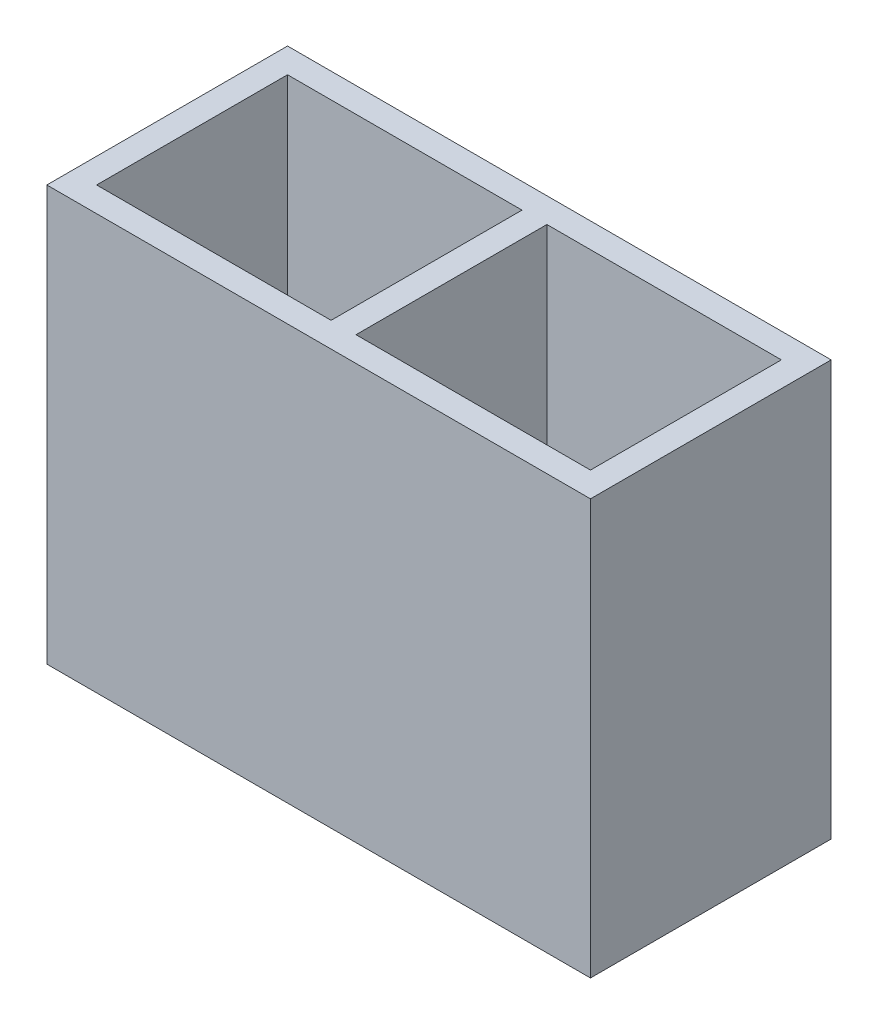
ISO-10303-21;
HEADER;
FILE_DESCRIPTION(('STEP AP214'),'2;1');
FILE_NAME('part.step','',(''),(''),'','','');
FILE_SCHEMA(('AUTOMOTIVE_DESIGN { 1 0 10303 214 1 1 1 1 }'));
ENDSEC;
DATA;
#1=APPLICATION_CONTEXT('core data for automotive mechanical design processes');
#2=APPLICATION_PROTOCOL_DEFINITION('international standard','automotive_design',2000,#1);
#3=PRODUCT_CONTEXT('',#1,'mechanical');
#4=PRODUCT('Part','Part','',(#3));
#5=PRODUCT_RELATED_PRODUCT_CATEGORY('part','',(#4));
#6=PRODUCT_DEFINITION_FORMATION('','',#4);
#7=PRODUCT_DEFINITION_CONTEXT('part definition',#1,'design');
#8=PRODUCT_DEFINITION('design','',#6,#7);
#9=PRODUCT_DEFINITION_SHAPE('','',#8);
#10=(LENGTH_UNIT() NAMED_UNIT(*) SI_UNIT(.MILLI.,.METRE.));
#11=(NAMED_UNIT(*) PLANE_ANGLE_UNIT() SI_UNIT($,.RADIAN.));
#12=(NAMED_UNIT(*) SI_UNIT($,.STERADIAN.) SOLID_ANGLE_UNIT());
#13=UNCERTAINTY_MEASURE_WITH_UNIT(LENGTH_MEASURE(1.E-05),#10,'distance_accuracy_value','');
#14=(GEOMETRIC_REPRESENTATION_CONTEXT(3) GLOBAL_UNCERTAINTY_ASSIGNED_CONTEXT((#13)) GLOBAL_UNIT_ASSIGNED_CONTEXT((#10,
#11,#12)) REPRESENTATION_CONTEXT('',''));
#15=CARTESIAN_POINT('',(0.,0.,0.));
#16=DIRECTION('',(0.,0.,1.));
#17=DIRECTION('',(1.,0.,0.));
#18=AXIS2_PLACEMENT_3D('',#15,#16,#17);
#19=CARTESIAN_POINT('',(-6.55,-5.,-2.9));
#20=DIRECTION('',(-1.,0.,0.));
#21=DIRECTION('',(0.,0.,1.));
#22=AXIS2_PLACEMENT_3D('',#19,#20,#21);
#23=PLANE('',#22);
#24=DIRECTION('',(0.,1.,0.));
#25=VECTOR('',#24,1.);
#26=CARTESIAN_POINT('',(-6.55,-5.,2.9));
#27=LINE('',#26,#25);
#28=CARTESIAN_POINT('',(-6.55,-5.,2.9));
#29=VERTEX_POINT('',#28);
#30=CARTESIAN_POINT('',(-6.55,5.,2.9));
#31=VERTEX_POINT('',#30);
#32=EDGE_CURVE('E213',#29,#31,#27,.T.);
#33=ORIENTED_EDGE('',*,*,#32,.T.);
#34=DIRECTION('',(0.,0.,1.));
#35=VECTOR('',#34,1.);
#36=CARTESIAN_POINT('',(-6.55,5.,-2.9));
#37=LINE('',#36,#35);
#38=CARTESIAN_POINT('',(-6.55,5.,-2.9));
#39=VERTEX_POINT('',#38);
#40=EDGE_CURVE('E163',#39,#31,#37,.T.);
#41=ORIENTED_EDGE('',*,*,#40,.F.);
#42=DIRECTION('',(0.,1.,0.));
#43=VECTOR('',#42,1.);
#44=CARTESIAN_POINT('',(-6.55,-5.,-2.9));
#45=LINE('',#44,#43);
#46=CARTESIAN_POINT('',(-6.55,-5.,-2.9));
#47=VERTEX_POINT('',#46);
#48=EDGE_CURVE('E12',#47,#39,#45,.T.);
#49=ORIENTED_EDGE('',*,*,#48,.F.);
#50=DIRECTION('',(0.,0.,1.));
#51=VECTOR('',#50,1.);
#52=CARTESIAN_POINT('',(-6.55,-5.,-2.9));
#53=LINE('',#52,#51);
#54=EDGE_CURVE('E202',#47,#29,#53,.T.);
#55=ORIENTED_EDGE('',*,*,#54,.T.);
#56=EDGE_LOOP('',(#33,#41,#49,#55));
#57=FACE_BOUND('',#56,.T.);
#58=ADVANCED_FACE('F39',(#57),#23,.T.);
#59=CARTESIAN_POINT('',(-6.55,-5.,-2.9));
#60=DIRECTION('',(0.,0.,-1.));
#61=DIRECTION('',(-1.,0.,0.));
#62=AXIS2_PLACEMENT_3D('',#59,#60,#61);
#63=PLANE('',#62);
#64=ORIENTED_EDGE('',*,*,#48,.T.);
#65=DIRECTION('',(-1.,0.,0.));
#66=VECTOR('',#65,1.);
#67=CARTESIAN_POINT('',(-6.55,5.,-2.9));
#68=LINE('',#67,#66);
#69=CARTESIAN_POINT('',(6.55,5.,-2.9));
#70=VERTEX_POINT('',#69);
#71=EDGE_CURVE('E199',#70,#39,#68,.T.);
#72=ORIENTED_EDGE('',*,*,#71,.F.);
#73=DIRECTION('',(0.,1.,0.));
#74=VECTOR('',#73,1.);
#75=CARTESIAN_POINT('',(6.55,-5.,-2.9));
#76=LINE('',#75,#74);
#77=CARTESIAN_POINT('',(6.55,-5.,-2.9));
#78=VERTEX_POINT('',#77);
#79=EDGE_CURVE('E47',#78,#70,#76,.T.);
#80=ORIENTED_EDGE('',*,*,#79,.F.);
#81=DIRECTION('',(-1.,0.,0.));
#82=VECTOR('',#81,1.);
#83=CARTESIAN_POINT('',(-6.55,-5.,-2.9));
#84=LINE('',#83,#82);
#85=EDGE_CURVE('E211',#78,#47,#84,.T.);
#86=ORIENTED_EDGE('',*,*,#85,.T.);
#87=EDGE_LOOP('',(#64,#72,#80,#86));
#88=FACE_BOUND('',#87,.T.);
#89=ADVANCED_FACE('F268',(#88),#63,.T.);
#90=CARTESIAN_POINT('',(6.55,-5.,-2.9));
#91=DIRECTION('',(1.,0.,0.));
#92=DIRECTION('',(0.,0.,-1.));
#93=AXIS2_PLACEMENT_3D('',#90,#91,#92);
#94=PLANE('',#93);
#95=ORIENTED_EDGE('',*,*,#79,.T.);
#96=DIRECTION('',(0.,0.,-1.));
#97=VECTOR('',#96,1.);
#98=CARTESIAN_POINT('',(6.55,5.,-2.9));
#99=LINE('',#98,#97);
#100=CARTESIAN_POINT('',(6.55,5.,2.9));
#101=VERTEX_POINT('',#100);
#102=EDGE_CURVE('E196',#101,#70,#99,.T.);
#103=ORIENTED_EDGE('',*,*,#102,.F.);
#104=DIRECTION('',(0.,1.,0.));
#105=VECTOR('',#104,1.);
#106=CARTESIAN_POINT('',(6.55,-5.,2.9));
#107=LINE('',#106,#105);
#108=CARTESIAN_POINT('',(6.55,-5.,2.9));
#109=VERTEX_POINT('',#108);
#110=EDGE_CURVE('E216',#109,#101,#107,.T.);
#111=ORIENTED_EDGE('',*,*,#110,.F.);
#112=DIRECTION('',(0.,0.,-1.));
#113=VECTOR('',#112,1.);
#114=CARTESIAN_POINT('',(6.55,-5.,-2.9));
#115=LINE('',#114,#113);
#116=EDGE_CURVE('E208',#109,#78,#115,.T.);
#117=ORIENTED_EDGE('',*,*,#116,.T.);
#118=EDGE_LOOP('',(#95,#103,#111,#117));
#119=FACE_BOUND('',#118,.T.);
#120=ADVANCED_FACE('F273',(#119),#94,.T.);
#121=CARTESIAN_POINT('',(-6.55,-5.,2.9));
#122=DIRECTION('',(0.,0.,1.));
#123=DIRECTION('',(1.,0.,0.));
#124=AXIS2_PLACEMENT_3D('',#121,#122,#123);
#125=PLANE('',#124);
#126=ORIENTED_EDGE('',*,*,#110,.T.);
#127=DIRECTION('',(1.,0.,0.));
#128=VECTOR('',#127,1.);
#129=CARTESIAN_POINT('',(-6.55,5.,2.9));
#130=LINE('',#129,#128);
#131=EDGE_CURVE('E193',#31,#101,#130,.T.);
#132=ORIENTED_EDGE('',*,*,#131,.F.);
#133=ORIENTED_EDGE('',*,*,#32,.F.);
#134=DIRECTION('',(1.,0.,0.));
#135=VECTOR('',#134,1.);
#136=CARTESIAN_POINT('',(-6.55,-5.,2.9));
#137=LINE('',#136,#135);
#138=EDGE_CURVE('E205',#29,#109,#137,.T.);
#139=ORIENTED_EDGE('',*,*,#138,.T.);
#140=EDGE_LOOP('',(#126,#132,#133,#139));
#141=FACE_BOUND('',#140,.T.);
#142=ADVANCED_FACE('F281',(#141),#125,.T.);
#143=CARTESIAN_POINT('',(0.,-5.,0.));
#144=DIRECTION('',(0.,1.,0.));
#145=DIRECTION('',(0.,0.,1.));
#146=AXIS2_PLACEMENT_3D('',#143,#144,#145);
#147=PLANE('',#146);
#148=CARTESIAN_POINT('',(-4.625,-5.,0.));
#149=DIRECTION('',(0.,1.,0.));
#150=DIRECTION('',(0.,0.,1.));
#151=AXIS2_PLACEMENT_3D('',#148,#149,#150);
#152=CIRCLE('',#151,0.750000000000001);
#153=CARTESIAN_POINT('',(-4.625,-5.,0.750000000000001));
#154=VERTEX_POINT('',#153);
#155=EDGE_CURVE('E223',#154,#154,#152,.T.);
#156=ORIENTED_EDGE('',*,*,#155,.T.);
#157=EDGE_LOOP('',(#156));
#158=FACE_BOUND('',#157,.T.);
#159=CARTESIAN_POINT('',(-1.625,-5.,0.));
#160=DIRECTION('',(0.,1.,0.));
#161=DIRECTION('',(0.,0.,-1.));
#162=AXIS2_PLACEMENT_3D('',#159,#160,#161);
#163=CIRCLE('',#162,0.75);
#164=CARTESIAN_POINT('',(-1.625,-5.,-0.75));
#165=VERTEX_POINT('',#164);
#166=EDGE_CURVE('E462',#165,#165,#163,.T.);
#167=ORIENTED_EDGE('',*,*,#166,.T.);
#168=EDGE_LOOP('',(#167));
#169=FACE_BOUND('',#168,.T.);
#170=CARTESIAN_POINT('',(1.625,-5.,0.));
#171=DIRECTION('',(0.,1.,0.));
#172=DIRECTION('',(0.,0.,1.));
#173=AXIS2_PLACEMENT_3D('',#170,#171,#172);
#174=CIRCLE('',#173,0.75);
#175=CARTESIAN_POINT('',(1.625,-5.,0.750000000000001));
#176=VERTEX_POINT('',#175);
#177=EDGE_CURVE('E459',#176,#176,#174,.T.);
#178=ORIENTED_EDGE('',*,*,#177,.T.);
#179=EDGE_LOOP('',(#178));
#180=FACE_BOUND('',#179,.T.);
#181=CARTESIAN_POINT('',(4.625,-5.,0.));
#182=DIRECTION('',(0.,1.,0.));
#183=DIRECTION('',(0.,0.,-1.));
#184=AXIS2_PLACEMENT_3D('',#181,#182,#183);
#185=CIRCLE('',#184,0.750000000000001);
#186=CARTESIAN_POINT('',(4.625,-5.,-0.750000000000001));
#187=VERTEX_POINT('',#186);
#188=EDGE_CURVE('E457',#187,#187,#185,.T.);
#189=ORIENTED_EDGE('',*,*,#188,.T.);
#190=EDGE_LOOP('',(#189));
#191=FACE_BOUND('',#190,.T.);
#192=ORIENTED_EDGE('',*,*,#54,.F.);
#193=ORIENTED_EDGE('',*,*,#85,.F.);
#194=ORIENTED_EDGE('',*,*,#116,.F.);
#195=ORIENTED_EDGE('',*,*,#138,.F.);
#196=EDGE_LOOP('',(#192,#193,#194,#195));
#197=FACE_BOUND('',#196,.T.);
#198=ADVANCED_FACE('F286',(#158,#169,#180,#191,#197),#147,.F.);
#199=CARTESIAN_POINT('',(0.,5.,0.));
#200=DIRECTION('',(0.,1.,0.));
#201=DIRECTION('',(0.,0.,1.));
#202=AXIS2_PLACEMENT_3D('',#199,#200,#201);
#203=PLANE('',#202);
#204=DIRECTION('',(0.,0.,1.));
#205=VECTOR('',#204,1.);
#206=CARTESIAN_POINT('',(-5.95,5.,-2.3));
#207=LINE('',#206,#205);
#208=CARTESIAN_POINT('',(-5.95,5.,-2.3));
#209=VERTEX_POINT('',#208);
#210=CARTESIAN_POINT('',(-5.95,5.,2.3));
#211=VERTEX_POINT('',#210);
#212=EDGE_CURVE('E55',#209,#211,#207,.T.);
#213=ORIENTED_EDGE('',*,*,#212,.F.);
#214=DIRECTION('',(-1.,0.,0.));
#215=VECTOR('',#214,1.);
#216=CARTESIAN_POINT('',(-5.95,5.,-2.3));
#217=LINE('',#216,#215);
#218=CARTESIAN_POINT('',(-0.3,5.,-2.3));
#219=VERTEX_POINT('',#218);
#220=EDGE_CURVE('E152',#219,#209,#217,.T.);
#221=ORIENTED_EDGE('',*,*,#220,.F.);
#222=DIRECTION('',(0.,0.,-1.));
#223=VECTOR('',#222,1.);
#224=CARTESIAN_POINT('',(-0.3,5.,-2.3));
#225=LINE('',#224,#223);
#226=CARTESIAN_POINT('',(-0.3,5.,2.3));
#227=VERTEX_POINT('',#226);
#228=EDGE_CURVE('E135',#227,#219,#225,.T.);
#229=ORIENTED_EDGE('',*,*,#228,.F.);
#230=DIRECTION('',(1.,0.,0.));
#231=VECTOR('',#230,1.);
#232=CARTESIAN_POINT('',(-5.95,5.,2.3));
#233=LINE('',#232,#231);
#234=EDGE_CURVE('E145',#211,#227,#233,.T.);
#235=ORIENTED_EDGE('',*,*,#234,.F.);
#236=EDGE_LOOP('',(#213,#221,#229,#235));
#237=FACE_BOUND('',#236,.T.);
#238=DIRECTION('',(1.,0.,0.));
#239=VECTOR('',#238,1.);
#240=CARTESIAN_POINT('',(0.3,5.,2.3));
#241=LINE('',#240,#239);
#242=CARTESIAN_POINT('',(0.3,5.,2.3));
#243=VERTEX_POINT('',#242);
#244=CARTESIAN_POINT('',(5.95,5.,2.3));
#245=VERTEX_POINT('',#244);
#246=EDGE_CURVE('E63',#243,#245,#241,.T.);
#247=ORIENTED_EDGE('',*,*,#246,.F.);
#248=DIRECTION('',(0.,0.,1.));
#249=VECTOR('',#248,1.);
#250=CARTESIAN_POINT('',(0.3,5.,-2.3));
#251=LINE('',#250,#249);
#252=CARTESIAN_POINT('',(0.3,5.,-2.3));
#253=VERTEX_POINT('',#252);
#254=EDGE_CURVE('E180',#253,#243,#251,.T.);
#255=ORIENTED_EDGE('',*,*,#254,.F.);
#256=DIRECTION('',(-1.,0.,0.));
#257=VECTOR('',#256,1.);
#258=CARTESIAN_POINT('',(0.3,5.,-2.3));
#259=LINE('',#258,#257);
#260=CARTESIAN_POINT('',(5.95,5.,-2.3));
#261=VERTEX_POINT('',#260);
#262=EDGE_CURVE('E177',#261,#253,#259,.T.);
#263=ORIENTED_EDGE('',*,*,#262,.F.);
#264=DIRECTION('',(0.,0.,-1.));
#265=VECTOR('',#264,1.);
#266=CARTESIAN_POINT('',(5.95,5.,-2.3));
#267=LINE('',#266,#265);
#268=EDGE_CURVE('E174',#245,#261,#267,.T.);
#269=ORIENTED_EDGE('',*,*,#268,.F.);
#270=EDGE_LOOP('',(#247,#255,#263,#269));
#271=FACE_BOUND('',#270,.T.);
#272=ORIENTED_EDGE('',*,*,#40,.T.);
#273=ORIENTED_EDGE('',*,*,#131,.T.);
#274=ORIENTED_EDGE('',*,*,#102,.T.);
#275=ORIENTED_EDGE('',*,*,#71,.T.);
#276=EDGE_LOOP('',(#272,#273,#274,#275));
#277=FACE_BOUND('',#276,.T.);
#278=ADVANCED_FACE('F149',(#237,#271,#277),#203,.T.);
#279=CARTESIAN_POINT('',(0.3,-12.2857738092807,2.3));
#280=DIRECTION('',(0.,0.,1.));
#281=DIRECTION('',(1.,0.,0.));
#282=AXIS2_PLACEMENT_3D('',#279,#280,#281);
#283=PLANE('',#282);
#284=DIRECTION('',(-1.,0.,0.));
#285=VECTOR('',#284,1.);
#286=CARTESIAN_POINT('',(0.3,-1.6,2.3));
#287=LINE('',#286,#285);
#288=CARTESIAN_POINT('',(5.95,-1.6,2.3));
#289=VERTEX_POINT('',#288);
#290=CARTESIAN_POINT('',(0.3,-1.6,2.3));
#291=VERTEX_POINT('',#290);
#292=EDGE_CURVE('E170',#289,#291,#287,.T.);
#293=ORIENTED_EDGE('',*,*,#292,.T.);
#294=DIRECTION('',(0.,1.,0.));
#295=VECTOR('',#294,1.);
#296=CARTESIAN_POINT('',(0.3,-12.2857738092807,2.3));
#297=LINE('',#296,#295);
#298=EDGE_CURVE('E168',#291,#243,#297,.T.);
#299=ORIENTED_EDGE('',*,*,#298,.T.);
#300=ORIENTED_EDGE('',*,*,#246,.T.);
#301=DIRECTION('',(0.,1.,0.));
#302=VECTOR('',#301,1.);
#303=CARTESIAN_POINT('',(5.95,-12.2857738092807,2.3));
#304=LINE('',#303,#302);
#305=EDGE_CURVE('E183',#289,#245,#304,.T.);
#306=ORIENTED_EDGE('',*,*,#305,.F.);
#307=EDGE_LOOP('',(#293,#299,#300,#306));
#308=FACE_BOUND('',#307,.T.);
#309=ADVANCED_FACE('F247',(#308),#283,.F.);
#310=CARTESIAN_POINT('',(0.3,-12.2857738092807,-2.3));
#311=DIRECTION('',(-1.,0.,0.));
#312=DIRECTION('',(0.,0.,1.));
#313=AXIS2_PLACEMENT_3D('',#310,#311,#312);
#314=PLANE('',#313);
#315=DIRECTION('',(0.,0.,-1.));
#316=VECTOR('',#315,1.);
#317=CARTESIAN_POINT('',(0.3,-1.6,-2.3));
#318=LINE('',#317,#316);
#319=CARTESIAN_POINT('',(0.3,-1.6,-2.3));
#320=VERTEX_POINT('',#319);
#321=EDGE_CURVE('E167',#291,#320,#318,.T.);
#322=ORIENTED_EDGE('',*,*,#321,.T.);
#323=DIRECTION('',(0.,1.,0.));
#324=VECTOR('',#323,1.);
#325=CARTESIAN_POINT('',(0.3,-12.2857738092807,-2.3));
#326=LINE('',#325,#324);
#327=EDGE_CURVE('E185',#320,#253,#326,.T.);
#328=ORIENTED_EDGE('',*,*,#327,.T.);
#329=ORIENTED_EDGE('',*,*,#254,.T.);
#330=ORIENTED_EDGE('',*,*,#298,.F.);
#331=EDGE_LOOP('',(#322,#328,#329,#330));
#332=FACE_BOUND('',#331,.T.);
#333=ADVANCED_FACE('F258',(#332),#314,.F.);
#334=CARTESIAN_POINT('',(0.3,-12.2857738092807,-2.3));
#335=DIRECTION('',(0.,0.,-1.));
#336=DIRECTION('',(-1.,0.,0.));
#337=AXIS2_PLACEMENT_3D('',#334,#335,#336);
#338=PLANE('',#337);
#339=DIRECTION('',(1.,0.,0.));
#340=VECTOR('',#339,1.);
#341=CARTESIAN_POINT('',(0.3,-1.6,-2.3));
#342=LINE('',#341,#340);
#343=CARTESIAN_POINT('',(5.95,-1.6,-2.3));
#344=VERTEX_POINT('',#343);
#345=EDGE_CURVE('E165',#320,#344,#342,.T.);
#346=ORIENTED_EDGE('',*,*,#345,.T.);
#347=DIRECTION('',(0.,1.,0.));
#348=VECTOR('',#347,1.);
#349=CARTESIAN_POINT('',(5.95,-12.2857738092807,-2.3));
#350=LINE('',#349,#348);
#351=EDGE_CURVE('E187',#344,#261,#350,.T.);
#352=ORIENTED_EDGE('',*,*,#351,.T.);
#353=ORIENTED_EDGE('',*,*,#262,.T.);
#354=ORIENTED_EDGE('',*,*,#327,.F.);
#355=EDGE_LOOP('',(#346,#352,#353,#354));
#356=FACE_BOUND('',#355,.T.);
#357=ADVANCED_FACE('F256',(#356),#338,.F.);
#358=CARTESIAN_POINT('',(5.95,-12.2857738092807,-2.3));
#359=DIRECTION('',(1.,0.,0.));
#360=DIRECTION('',(0.,0.,-1.));
#361=AXIS2_PLACEMENT_3D('',#358,#359,#360);
#362=PLANE('',#361);
#363=DIRECTION('',(0.,0.,1.));
#364=VECTOR('',#363,1.);
#365=CARTESIAN_POINT('',(5.95,-1.6,-2.3));
#366=LINE('',#365,#364);
#367=EDGE_CURVE('E172',#344,#289,#366,.T.);
#368=ORIENTED_EDGE('',*,*,#367,.T.);
#369=ORIENTED_EDGE('',*,*,#305,.T.);
#370=ORIENTED_EDGE('',*,*,#268,.T.);
#371=ORIENTED_EDGE('',*,*,#351,.F.);
#372=EDGE_LOOP('',(#368,#369,#370,#371));
#373=FACE_BOUND('',#372,.T.);
#374=ADVANCED_FACE('F239',(#373),#362,.F.);
#375=CARTESIAN_POINT('',(0.,-1.6,0.));
#376=DIRECTION('',(0.,1.,0.));
#377=DIRECTION('',(0.,0.,1.));
#378=AXIS2_PLACEMENT_3D('',#375,#376,#377);
#379=PLANE('',#378);
#380=CARTESIAN_POINT('',(1.625,-1.6,0.));
#381=DIRECTION('',(0.,1.,0.));
#382=DIRECTION('',(0.,0.,1.));
#383=AXIS2_PLACEMENT_3D('',#380,#381,#382);
#384=CIRCLE('',#383,0.75);
#385=CARTESIAN_POINT('',(1.625,-1.6,0.750000000000001));
#386=VERTEX_POINT('',#385);
#387=EDGE_CURVE('E42',#386,#386,#384,.T.);
#388=ORIENTED_EDGE('',*,*,#387,.F.);
#389=EDGE_LOOP('',(#388));
#390=FACE_BOUND('',#389,.T.);
#391=CARTESIAN_POINT('',(4.625,-1.6,0.));
#392=DIRECTION('',(0.,1.,0.));
#393=DIRECTION('',(0.,0.,1.));
#394=AXIS2_PLACEMENT_3D('',#391,#392,#393);
#395=CIRCLE('',#394,0.750000000000001);
#396=CARTESIAN_POINT('',(4.625,-1.6,0.750000000000001));
#397=VERTEX_POINT('',#396);
#398=EDGE_CURVE('E225',#397,#397,#395,.T.);
#399=ORIENTED_EDGE('',*,*,#398,.F.);
#400=EDGE_LOOP('',(#399));
#401=FACE_BOUND('',#400,.T.);
#402=ORIENTED_EDGE('',*,*,#292,.F.);
#403=ORIENTED_EDGE('',*,*,#367,.F.);
#404=ORIENTED_EDGE('',*,*,#345,.F.);
#405=ORIENTED_EDGE('',*,*,#321,.F.);
#406=EDGE_LOOP('',(#402,#403,#404,#405));
#407=FACE_BOUND('',#406,.T.);
#408=ADVANCED_FACE('F235',(#390,#401,#407),#379,.T.);
#409=CARTESIAN_POINT('',(-5.95,-12.2857738092807,-2.3));
#410=DIRECTION('',(-1.,0.,0.));
#411=DIRECTION('',(0.,0.,1.));
#412=AXIS2_PLACEMENT_3D('',#409,#410,#411);
#413=PLANE('',#412);
#414=DIRECTION('',(0.,0.,-1.));
#415=VECTOR('',#414,1.);
#416=CARTESIAN_POINT('',(-5.95,-1.6,-2.3));
#417=LINE('',#416,#415);
#418=CARTESIAN_POINT('',(-5.95,-1.6,2.3));
#419=VERTEX_POINT('',#418);
#420=CARTESIAN_POINT('',(-5.95,-1.6,-2.3));
#421=VERTEX_POINT('',#420);
#422=EDGE_CURVE('E164',#419,#421,#417,.T.);
#423=ORIENTED_EDGE('',*,*,#422,.T.);
#424=DIRECTION('',(0.,1.,0.));
#425=VECTOR('',#424,1.);
#426=CARTESIAN_POINT('',(-5.95,-12.2857738092807,-2.3));
#427=LINE('',#426,#425);
#428=EDGE_CURVE('E157',#421,#209,#427,.T.);
#429=ORIENTED_EDGE('',*,*,#428,.T.);
#430=ORIENTED_EDGE('',*,*,#212,.T.);
#431=DIRECTION('',(0.,1.,0.));
#432=VECTOR('',#431,1.);
#433=CARTESIAN_POINT('',(-5.95,-12.2857738092807,2.3));
#434=LINE('',#433,#432);
#435=EDGE_CURVE('E142',#419,#211,#434,.T.);
#436=ORIENTED_EDGE('',*,*,#435,.F.);
#437=EDGE_LOOP('',(#423,#429,#430,#436));
#438=FACE_BOUND('',#437,.T.);
#439=ADVANCED_FACE('F238',(#438),#413,.F.);
#440=CARTESIAN_POINT('',(-5.95,-12.2857738092807,-2.3));
#441=DIRECTION('',(0.,0.,-1.));
#442=DIRECTION('',(-1.,0.,0.));
#443=AXIS2_PLACEMENT_3D('',#440,#441,#442);
#444=PLANE('',#443);
#445=DIRECTION('',(1.,0.,0.));
#446=VECTOR('',#445,1.);
#447=CARTESIAN_POINT('',(-5.95,-1.6,-2.3));
#448=LINE('',#447,#446);
#449=CARTESIAN_POINT('',(-0.3,-1.6,-2.3));
#450=VERTEX_POINT('',#449);
#451=EDGE_CURVE('E467',#421,#450,#448,.T.);
#452=ORIENTED_EDGE('',*,*,#451,.T.);
#453=DIRECTION('',(0.,1.,0.));
#454=VECTOR('',#453,1.);
#455=CARTESIAN_POINT('',(-0.3,-12.2857738092807,-2.3));
#456=LINE('',#455,#454);
#457=EDGE_CURVE('E141',#450,#219,#456,.T.);
#458=ORIENTED_EDGE('',*,*,#457,.T.);
#459=ORIENTED_EDGE('',*,*,#220,.T.);
#460=ORIENTED_EDGE('',*,*,#428,.F.);
#461=EDGE_LOOP('',(#452,#458,#459,#460));
#462=FACE_BOUND('',#461,.T.);
#463=ADVANCED_FACE('F317',(#462),#444,.F.);
#464=CARTESIAN_POINT('',(-0.3,-12.2857738092807,-2.3));
#465=DIRECTION('',(1.,0.,0.));
#466=DIRECTION('',(0.,0.,-1.));
#467=AXIS2_PLACEMENT_3D('',#464,#465,#466);
#468=PLANE('',#467);
#469=DIRECTION('',(0.,0.,1.));
#470=VECTOR('',#469,1.);
#471=CARTESIAN_POINT('',(-0.3,-1.6,-2.3));
#472=LINE('',#471,#470);
#473=CARTESIAN_POINT('',(-0.3,-1.6,2.3));
#474=VERTEX_POINT('',#473);
#475=EDGE_CURVE('E138',#450,#474,#472,.T.);
#476=ORIENTED_EDGE('',*,*,#475,.T.);
#477=DIRECTION('',(0.,1.,0.));
#478=VECTOR('',#477,1.);
#479=CARTESIAN_POINT('',(-0.3,-12.2857738092807,2.3));
#480=LINE('',#479,#478);
#481=EDGE_CURVE('E130',#474,#227,#480,.T.);
#482=ORIENTED_EDGE('',*,*,#481,.T.);
#483=ORIENTED_EDGE('',*,*,#228,.T.);
#484=ORIENTED_EDGE('',*,*,#457,.F.);
#485=EDGE_LOOP('',(#476,#482,#483,#484));
#486=FACE_BOUND('',#485,.T.);
#487=ADVANCED_FACE('F132',(#486),#468,.F.);
#488=CARTESIAN_POINT('',(-5.95,-12.2857738092807,2.3));
#489=DIRECTION('',(0.,0.,1.));
#490=DIRECTION('',(1.,0.,0.));
#491=AXIS2_PLACEMENT_3D('',#488,#489,#490);
#492=PLANE('',#491);
#493=DIRECTION('',(-1.,0.,0.));
#494=VECTOR('',#493,1.);
#495=CARTESIAN_POINT('',(-5.95,-1.6,2.3));
#496=LINE('',#495,#494);
#497=EDGE_CURVE('E161',#474,#419,#496,.T.);
#498=ORIENTED_EDGE('',*,*,#497,.T.);
#499=ORIENTED_EDGE('',*,*,#435,.T.);
#500=ORIENTED_EDGE('',*,*,#234,.T.);
#501=ORIENTED_EDGE('',*,*,#481,.F.);
#502=EDGE_LOOP('',(#498,#499,#500,#501));
#503=FACE_BOUND('',#502,.T.);
#504=ADVANCED_FACE('F146',(#503),#492,.F.);
#505=CARTESIAN_POINT('',(0.,-1.6,0.));
#506=DIRECTION('',(0.,1.,0.));
#507=DIRECTION('',(0.,0.,1.));
#508=AXIS2_PLACEMENT_3D('',#505,#506,#507);
#509=PLANE('',#508);
#510=CARTESIAN_POINT('',(-4.625,-1.6,0.));
#511=DIRECTION('',(0.,1.,0.));
#512=DIRECTION('',(0.,0.,1.));
#513=AXIS2_PLACEMENT_3D('',#510,#511,#512);
#514=CIRCLE('',#513,0.750000000000001);
#515=CARTESIAN_POINT('',(-4.625,-1.6,0.750000000000001));
#516=VERTEX_POINT('',#515);
#517=EDGE_CURVE('E222',#516,#516,#514,.T.);
#518=ORIENTED_EDGE('',*,*,#517,.F.);
#519=EDGE_LOOP('',(#518));
#520=FACE_BOUND('',#519,.T.);
#521=CARTESIAN_POINT('',(-1.625,-1.6,0.));
#522=DIRECTION('',(0.,1.,0.));
#523=DIRECTION('',(0.,0.,1.));
#524=AXIS2_PLACEMENT_3D('',#521,#522,#523);
#525=CIRCLE('',#524,0.75);
#526=CARTESIAN_POINT('',(-1.625,-1.6,0.750000000000001));
#527=VERTEX_POINT('',#526);
#528=EDGE_CURVE('E219',#527,#527,#525,.T.);
#529=ORIENTED_EDGE('',*,*,#528,.F.);
#530=EDGE_LOOP('',(#529));
#531=FACE_BOUND('',#530,.T.);
#532=ORIENTED_EDGE('',*,*,#422,.F.);
#533=ORIENTED_EDGE('',*,*,#497,.F.);
#534=ORIENTED_EDGE('',*,*,#475,.F.);
#535=ORIENTED_EDGE('',*,*,#451,.F.);
#536=EDGE_LOOP('',(#532,#533,#534,#535));
#537=FACE_BOUND('',#536,.T.);
#538=ADVANCED_FACE('F337',(#520,#531,#537),#509,.T.);
#539=CARTESIAN_POINT('',(-1.625,-5.,0.));
#540=DIRECTION('',(0.,1.,0.));
#541=DIRECTION('',(0.,0.,1.));
#542=AXIS2_PLACEMENT_3D('',#539,#540,#541);
#543=CYLINDRICAL_SURFACE('',#542,0.75);
#544=ORIENTED_EDGE('',*,*,#528,.T.);
#545=EDGE_LOOP('',(#544));
#546=FACE_BOUND('',#545,.T.);
#547=ORIENTED_EDGE('',*,*,#166,.F.);
#548=EDGE_LOOP('',(#547));
#549=FACE_BOUND('',#548,.T.);
#550=ADVANCED_FACE('F343',(#546,#549),#543,.F.);
#551=CARTESIAN_POINT('',(-4.625,-5.,0.));
#552=DIRECTION('',(0.,1.,0.));
#553=DIRECTION('',(0.,0.,1.));
#554=AXIS2_PLACEMENT_3D('',#551,#552,#553);
#555=CYLINDRICAL_SURFACE('',#554,0.750000000000001);
#556=ORIENTED_EDGE('',*,*,#517,.T.);
#557=EDGE_LOOP('',(#556));
#558=FACE_BOUND('',#557,.T.);
#559=ORIENTED_EDGE('',*,*,#155,.F.);
#560=EDGE_LOOP('',(#559));
#561=FACE_BOUND('',#560,.T.);
#562=ADVANCED_FACE('F351',(#558,#561),#555,.F.);
#563=CARTESIAN_POINT('',(4.625,-5.,0.));
#564=DIRECTION('',(0.,1.,0.));
#565=DIRECTION('',(0.,0.,1.));
#566=AXIS2_PLACEMENT_3D('',#563,#564,#565);
#567=CYLINDRICAL_SURFACE('',#566,0.750000000000001);
#568=ORIENTED_EDGE('',*,*,#398,.T.);
#569=EDGE_LOOP('',(#568));
#570=FACE_BOUND('',#569,.T.);
#571=ORIENTED_EDGE('',*,*,#188,.F.);
#572=EDGE_LOOP('',(#571));
#573=FACE_BOUND('',#572,.T.);
#574=ADVANCED_FACE('F359',(#570,#573),#567,.F.);
#575=CARTESIAN_POINT('',(1.625,-5.,0.));
#576=DIRECTION('',(0.,1.,0.));
#577=DIRECTION('',(0.,0.,1.));
#578=AXIS2_PLACEMENT_3D('',#575,#576,#577);
#579=CYLINDRICAL_SURFACE('',#578,0.75);
#580=ORIENTED_EDGE('',*,*,#387,.T.);
#581=EDGE_LOOP('',(#580));
#582=FACE_BOUND('',#581,.T.);
#583=ORIENTED_EDGE('',*,*,#177,.F.);
#584=EDGE_LOOP('',(#583));
#585=FACE_BOUND('',#584,.T.);
#586=ADVANCED_FACE('F232',(#582,#585),#579,.F.);
#587=CLOSED_SHELL('',(#58,#89,#120,#142,#198,#278,#309,#333,#357,#374,#408,#439,#463,#487,#504,
#538,#550,#562,#574,#586));
#588=MANIFOLD_SOLID_BREP('B2',#587);
#589=ADVANCED_BREP_SHAPE_REPRESENTATION('',(#18,#588),#14);
#590=SHAPE_DEFINITION_REPRESENTATION(#9,#589);
ENDSEC;
END-ISO-10303-21;
